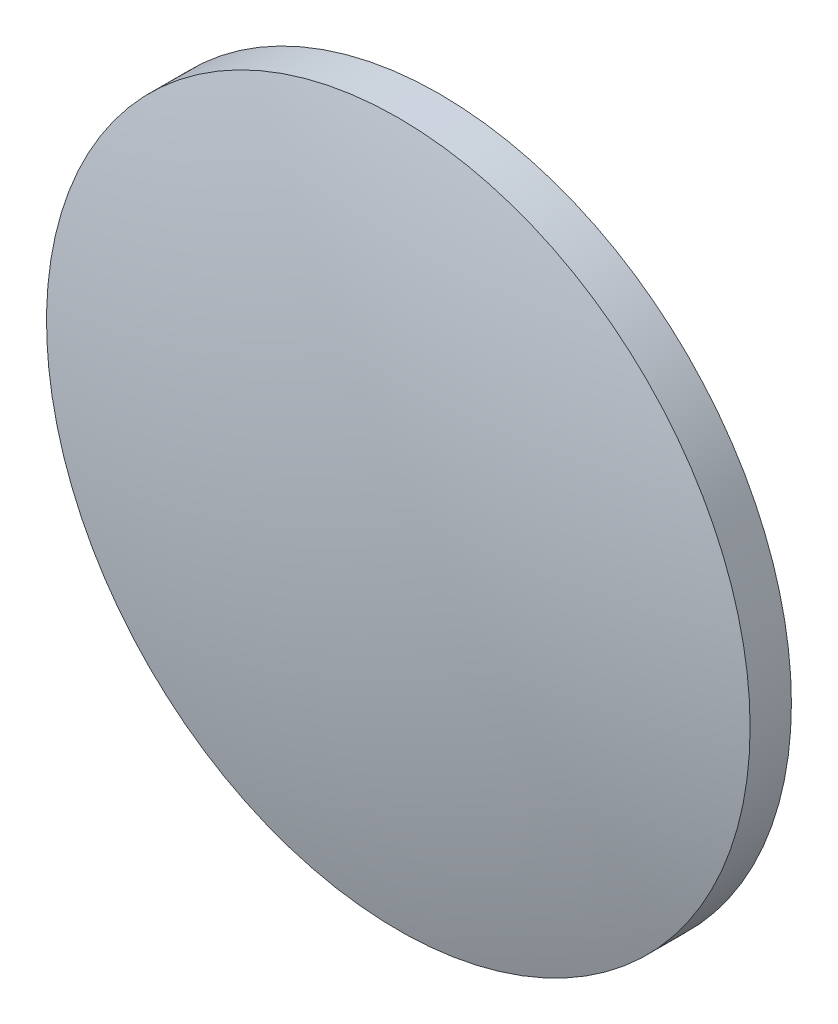
ISO-10303-21;
HEADER;
FILE_DESCRIPTION(('STEP AP214'),'2;1');
FILE_NAME('part.step','',(''),(''),'','','');
FILE_SCHEMA(('AUTOMOTIVE_DESIGN { 1 0 10303 214 1 1 1 1 }'));
ENDSEC;
DATA;
#1=APPLICATION_CONTEXT('core data for automotive mechanical design processes');
#2=APPLICATION_PROTOCOL_DEFINITION('international standard','automotive_design',2000,#1);
#3=PRODUCT_CONTEXT('',#1,'mechanical');
#4=PRODUCT('Part','Part','',(#3));
#5=PRODUCT_RELATED_PRODUCT_CATEGORY('part','',(#4));
#6=PRODUCT_DEFINITION_FORMATION('','',#4);
#7=PRODUCT_DEFINITION_CONTEXT('part definition',#1,'design');
#8=PRODUCT_DEFINITION('design','',#6,#7);
#9=PRODUCT_DEFINITION_SHAPE('','',#8);
#10=(LENGTH_UNIT() NAMED_UNIT(*) SI_UNIT(.MILLI.,.METRE.));
#11=(NAMED_UNIT(*) PLANE_ANGLE_UNIT() SI_UNIT($,.RADIAN.));
#12=(NAMED_UNIT(*) SI_UNIT($,.STERADIAN.) SOLID_ANGLE_UNIT());
#13=UNCERTAINTY_MEASURE_WITH_UNIT(LENGTH_MEASURE(1.E-05),#10,'distance_accuracy_value','');
#14=(GEOMETRIC_REPRESENTATION_CONTEXT(3) GLOBAL_UNCERTAINTY_ASSIGNED_CONTEXT((#13)) GLOBAL_UNIT_ASSIGNED_CONTEXT((#10,
#11,#12)) REPRESENTATION_CONTEXT('',''));
#15=CARTESIAN_POINT('',(0.,0.,0.));
#16=DIRECTION('',(0.,0.,1.));
#17=DIRECTION('',(1.,0.,0.));
#18=AXIS2_PLACEMENT_3D('',#15,#16,#17);
#19=CARTESIAN_POINT('',(0.,0.,-96.9509468956087));
#20=DIRECTION('',(0.,0.,1.));
#21=DIRECTION('',(0.,1.,0.));
#22=AXIS2_PLACEMENT_3D('',#19,#20,#21);
#23=SPHERICAL_SURFACE('',#22,100.08);
#24=CARTESIAN_POINT('',(0.,0.,-0.147814714878082));
#25=DIRECTION('',(0.,0.,1.));
#26=DIRECTION('',(1.,0.,0.));
#27=AXIS2_PLACEMENT_3D('',#24,#25,#26);
#28=CIRCLE('',#27,25.4);
#29=CARTESIAN_POINT('',(25.4,0.,-0.147814714878082));
#30=VERTEX_POINT('',#29);
#31=EDGE_CURVE('E8',#30,#30,#28,.T.);
#32=ORIENTED_EDGE('',*,*,#31,.T.);
#33=EDGE_LOOP('',(#32));
#34=FACE_BOUND('',#33,.T.);
#35=ADVANCED_FACE('F12',(#34),#23,.T.);
#36=CARTESIAN_POINT('',(0.,0.,9.48415685923238));
#37=DIRECTION('',(0.,0.,1.));
#38=DIRECTION('',(1.,0.,0.));
#39=AXIS2_PLACEMENT_3D('',#36,#37,#38);
#40=CYLINDRICAL_SURFACE('',#39,25.4);
#41=ORIENTED_EDGE('',*,*,#31,.F.);
#42=EDGE_LOOP('',(#41));
#43=FACE_BOUND('',#42,.T.);
#44=CARTESIAN_POINT('',(0.,0.,-3.12905310439132));
#45=DIRECTION('',(0.,0.,1.));
#46=DIRECTION('',(1.,0.,0.));
#47=AXIS2_PLACEMENT_3D('',#44,#45,#46);
#48=CIRCLE('',#47,25.4);
#49=CARTESIAN_POINT('',(25.4,0.,-3.12905310439132));
#50=VERTEX_POINT('',#49);
#51=EDGE_CURVE('E18',#50,#50,#48,.T.);
#52=ORIENTED_EDGE('',*,*,#51,.T.);
#53=EDGE_LOOP('',(#52));
#54=FACE_BOUND('',#53,.T.);
#55=ADVANCED_FACE('F24',(#43,#54),#40,.T.);
#56=CARTESIAN_POINT('',(0.,0.,-281.090946895609));
#57=DIRECTION('',(0.,0.,1.));
#58=DIRECTION('',(0.,1.,0.));
#59=AXIS2_PLACEMENT_3D('',#56,#57,#58);
#60=SPHERICAL_SURFACE('',#59,279.12);
#61=ORIENTED_EDGE('',*,*,#51,.F.);
#62=EDGE_LOOP('',(#61));
#63=FACE_BOUND('',#62,.T.);
#64=ADVANCED_FACE('F26',(#63),#60,.F.);
#65=CLOSED_SHELL('',(#35,#55,#64));
#66=MANIFOLD_SOLID_BREP('B1',#65);
#67=ADVANCED_BREP_SHAPE_REPRESENTATION('',(#18,#66),#14);
#68=SHAPE_DEFINITION_REPRESENTATION(#9,#67);
ENDSEC;
END-ISO-10303-21;
